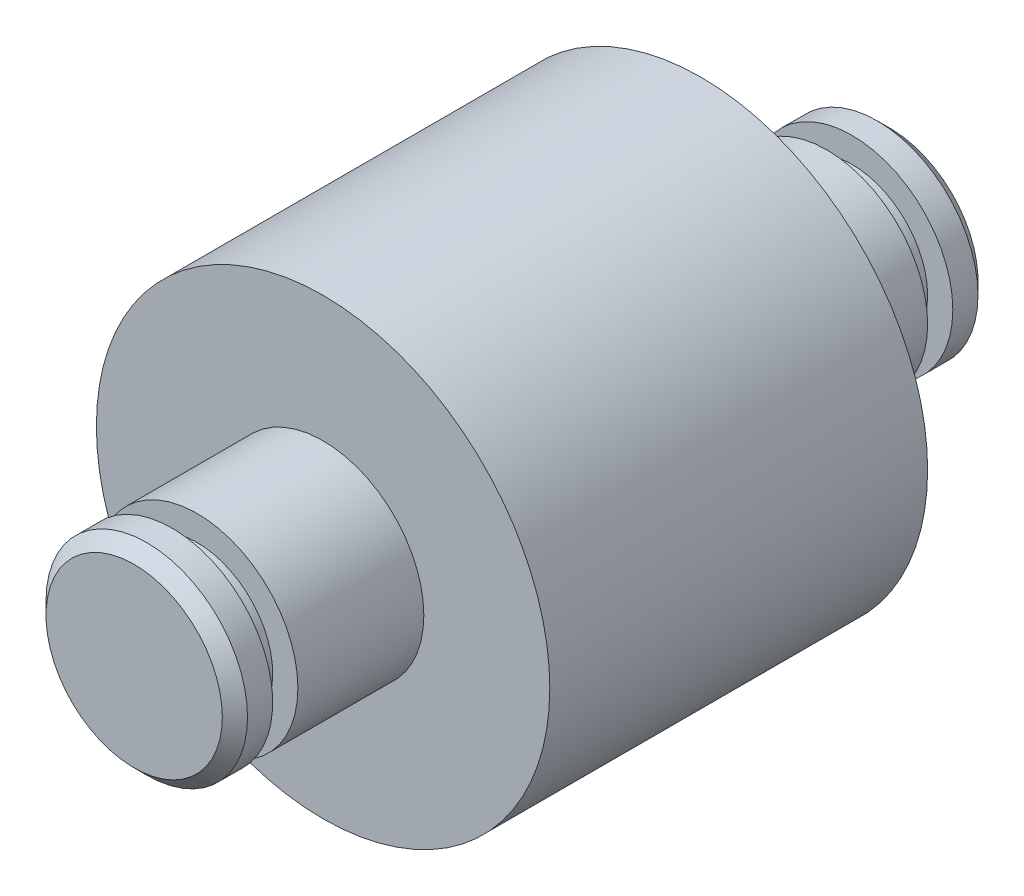
ISO-10303-21;
HEADER;
FILE_DESCRIPTION(('STEP AP214'),'2;1');
FILE_NAME('part.step','',(''),(''),'','','');
FILE_SCHEMA(('AUTOMOTIVE_DESIGN { 1 0 10303 214 1 1 1 1 }'));
ENDSEC;
DATA;
#1=APPLICATION_CONTEXT('core data for automotive mechanical design processes');
#2=APPLICATION_PROTOCOL_DEFINITION('international standard','automotive_design',2000,#1);
#3=PRODUCT_CONTEXT('',#1,'mechanical');
#4=PRODUCT('Part','Part','',(#3));
#5=PRODUCT_RELATED_PRODUCT_CATEGORY('part','',(#4));
#6=PRODUCT_DEFINITION_FORMATION('','',#4);
#7=PRODUCT_DEFINITION_CONTEXT('part definition',#1,'design');
#8=PRODUCT_DEFINITION('design','',#6,#7);
#9=PRODUCT_DEFINITION_SHAPE('','',#8);
#10=(LENGTH_UNIT() NAMED_UNIT(*) SI_UNIT(.MILLI.,.METRE.));
#11=(NAMED_UNIT(*) PLANE_ANGLE_UNIT() SI_UNIT($,.RADIAN.));
#12=(NAMED_UNIT(*) SI_UNIT($,.STERADIAN.) SOLID_ANGLE_UNIT());
#13=UNCERTAINTY_MEASURE_WITH_UNIT(LENGTH_MEASURE(1.E-05),#10,'distance_accuracy_value','');
#14=(GEOMETRIC_REPRESENTATION_CONTEXT(3) GLOBAL_UNCERTAINTY_ASSIGNED_CONTEXT((#13)) GLOBAL_UNIT_ASSIGNED_CONTEXT((#10,
#11,#12)) REPRESENTATION_CONTEXT('',''));
#15=CARTESIAN_POINT('',(0.,0.,0.));
#16=DIRECTION('',(0.,0.,1.));
#17=DIRECTION('',(1.,0.,0.));
#18=AXIS2_PLACEMENT_3D('',#15,#16,#17);
#19=CARTESIAN_POINT('',(0.,0.,-15.));
#20=DIRECTION('',(0.,0.,1.));
#21=DIRECTION('',(1.,0.,0.));
#22=AXIS2_PLACEMENT_3D('',#19,#20,#21);
#23=CYLINDRICAL_SURFACE('',#22,4.);
#24=CARTESIAN_POINT('',(0.,0.,-7.5));
#25=DIRECTION('',(0.,0.,1.));
#26=DIRECTION('',(1.,0.,0.));
#27=AXIS2_PLACEMENT_3D('',#24,#25,#26);
#28=CIRCLE('',#27,4.);
#29=CARTESIAN_POINT('',(4.,0.,-7.5));
#30=VERTEX_POINT('',#29);
#31=EDGE_CURVE('E53',#30,#30,#28,.T.);
#32=ORIENTED_EDGE('',*,*,#31,.F.);
#33=EDGE_LOOP('',(#32));
#34=FACE_BOUND('',#33,.T.);
#35=CARTESIAN_POINT('',(0.,0.,-12.5));
#36=DIRECTION('',(0.,0.,-1.));
#37=DIRECTION('',(-1.,0.,0.));
#38=AXIS2_PLACEMENT_3D('',#35,#36,#37);
#39=CIRCLE('',#38,4.);
#40=CARTESIAN_POINT('',(-4.,0.,-12.5));
#41=VERTEX_POINT('',#40);
#42=EDGE_CURVE('E54',#41,#41,#39,.F.);
#43=ORIENTED_EDGE('',*,*,#42,.T.);
#44=EDGE_LOOP('',(#43));
#45=FACE_BOUND('',#44,.T.);
#46=ADVANCED_FACE('F32',(#34,#45),#23,.T.);
#47=CARTESIAN_POINT('',(0.,0.,15.));
#48=DIRECTION('',(0.,0.,-1.));
#49=DIRECTION('',(-1.,0.,0.));
#50=AXIS2_PLACEMENT_3D('',#47,#48,#49);
#51=CYLINDRICAL_SURFACE('',#50,4.);
#52=CARTESIAN_POINT('',(0.,0.,7.5));
#53=DIRECTION('',(0.,0.,1.));
#54=DIRECTION('',(1.,0.,0.));
#55=AXIS2_PLACEMENT_3D('',#52,#53,#54);
#56=CIRCLE('',#55,4.);
#57=CARTESIAN_POINT('',(4.,0.,7.5));
#58=VERTEX_POINT('',#57);
#59=EDGE_CURVE('E60',#58,#58,#56,.T.);
#60=ORIENTED_EDGE('',*,*,#59,.T.);
#61=EDGE_LOOP('',(#60));
#62=FACE_BOUND('',#61,.T.);
#63=CARTESIAN_POINT('',(0.,0.,12.5));
#64=DIRECTION('',(0.,0.,1.));
#65=DIRECTION('',(1.,0.,0.));
#66=AXIS2_PLACEMENT_3D('',#63,#64,#65);
#67=CIRCLE('',#66,4.);
#68=CARTESIAN_POINT('',(4.,0.,12.5));
#69=VERTEX_POINT('',#68);
#70=EDGE_CURVE('E65',#69,#69,#67,.T.);
#71=ORIENTED_EDGE('',*,*,#70,.F.);
#72=EDGE_LOOP('',(#71));
#73=FACE_BOUND('',#72,.T.);
#74=ADVANCED_FACE('F111',(#62,#73),#51,.T.);
#75=CARTESIAN_POINT('',(0.,0.,7.5));
#76=DIRECTION('',(0.,0.,-1.));
#77=DIRECTION('',(-1.,0.,0.));
#78=AXIS2_PLACEMENT_3D('',#75,#76,#77);
#79=CYLINDRICAL_SURFACE('',#78,9.);
#80=CARTESIAN_POINT('',(0.,0.,7.5));
#81=DIRECTION('',(0.,0.,1.));
#82=DIRECTION('',(1.,0.,0.));
#83=AXIS2_PLACEMENT_3D('',#80,#81,#82);
#84=CIRCLE('',#83,9.);
#85=CARTESIAN_POINT('',(9.,0.,7.5));
#86=VERTEX_POINT('',#85);
#87=EDGE_CURVE('E64',#86,#86,#84,.T.);
#88=ORIENTED_EDGE('',*,*,#87,.F.);
#89=EDGE_LOOP('',(#88));
#90=FACE_BOUND('',#89,.T.);
#91=CARTESIAN_POINT('',(0.,0.,-7.5));
#92=DIRECTION('',(0.,0.,1.));
#93=DIRECTION('',(1.,0.,0.));
#94=AXIS2_PLACEMENT_3D('',#91,#92,#93);
#95=CIRCLE('',#94,9.);
#96=CARTESIAN_POINT('',(9.,0.,-7.5));
#97=VERTEX_POINT('',#96);
#98=EDGE_CURVE('E78',#97,#97,#95,.T.);
#99=ORIENTED_EDGE('',*,*,#98,.T.);
#100=EDGE_LOOP('',(#99));
#101=FACE_BOUND('',#100,.T.);
#102=ADVANCED_FACE('F118',(#90,#101),#79,.T.);
#103=CARTESIAN_POINT('',(0.,0.,7.5));
#104=DIRECTION('',(0.,0.,1.));
#105=DIRECTION('',(1.,0.,0.));
#106=AXIS2_PLACEMENT_3D('',#103,#104,#105);
#107=PLANE('',#106);
#108=ORIENTED_EDGE('',*,*,#59,.F.);
#109=EDGE_LOOP('',(#108));
#110=FACE_BOUND('',#109,.T.);
#111=ORIENTED_EDGE('',*,*,#87,.T.);
#112=EDGE_LOOP('',(#111));
#113=FACE_BOUND('',#112,.T.);
#114=ADVANCED_FACE('F165',(#110,#113),#107,.T.);
#115=CARTESIAN_POINT('',(0.,4.61399314228175,13.5));
#116=DIRECTION('',(0.,0.,-1.));
#117=DIRECTION('',(-1.,0.,0.));
#118=AXIS2_PLACEMENT_3D('',#115,#116,#117);
#119=PLANE('',#118);
#120=CARTESIAN_POINT('',(0.,0.,13.5));
#121=DIRECTION('',(0.,0.,1.));
#122=DIRECTION('',(1.,0.,0.));
#123=AXIS2_PLACEMENT_3D('',#120,#121,#122);
#124=CIRCLE('',#123,3.);
#125=CARTESIAN_POINT('',(3.,0.,13.5));
#126=VERTEX_POINT('',#125);
#127=EDGE_CURVE('E68',#126,#126,#124,.T.);
#128=ORIENTED_EDGE('',*,*,#127,.T.);
#129=EDGE_LOOP('',(#128));
#130=FACE_BOUND('',#129,.T.);
#131=CARTESIAN_POINT('',(0.,0.,13.5));
#132=DIRECTION('',(0.,0.,-1.));
#133=DIRECTION('',(-1.,0.,0.));
#134=AXIS2_PLACEMENT_3D('',#131,#132,#133);
#135=CIRCLE('',#134,4.);
#136=CARTESIAN_POINT('',(-4.,0.,13.5));
#137=VERTEX_POINT('',#136);
#138=EDGE_CURVE('E61',#137,#137,#135,.T.);
#139=ORIENTED_EDGE('',*,*,#138,.T.);
#140=EDGE_LOOP('',(#139));
#141=FACE_BOUND('',#140,.T.);
#142=ADVANCED_FACE('F221',(#130,#141),#119,.T.);
#143=CARTESIAN_POINT('',(0.,4.61399314228175,12.5));
#144=DIRECTION('',(0.,0.,1.));
#145=DIRECTION('',(1.,0.,0.));
#146=AXIS2_PLACEMENT_3D('',#143,#144,#145);
#147=PLANE('',#146);
#148=CARTESIAN_POINT('',(0.,0.,12.5));
#149=DIRECTION('',(0.,0.,1.));
#150=DIRECTION('',(1.,0.,0.));
#151=AXIS2_PLACEMENT_3D('',#148,#149,#150);
#152=CIRCLE('',#151,3.);
#153=CARTESIAN_POINT('',(3.,0.,12.5));
#154=VERTEX_POINT('',#153);
#155=EDGE_CURVE('E75',#154,#154,#152,.T.);
#156=ORIENTED_EDGE('',*,*,#155,.F.);
#157=EDGE_LOOP('',(#156));
#158=FACE_BOUND('',#157,.T.);
#159=ORIENTED_EDGE('',*,*,#70,.T.);
#160=EDGE_LOOP('',(#159));
#161=FACE_BOUND('',#160,.T.);
#162=ADVANCED_FACE('F211',(#158,#161),#147,.T.);
#163=CARTESIAN_POINT('',(0.,0.,15.));
#164=DIRECTION('',(0.,0.,1.));
#165=DIRECTION('',(1.,0.,0.));
#166=AXIS2_PLACEMENT_3D('',#163,#164,#165);
#167=CYLINDRICAL_SURFACE('',#166,3.);
#168=ORIENTED_EDGE('',*,*,#155,.T.);
#169=EDGE_LOOP('',(#168));
#170=FACE_BOUND('',#169,.T.);
#171=ORIENTED_EDGE('',*,*,#127,.F.);
#172=EDGE_LOOP('',(#171));
#173=FACE_BOUND('',#172,.T.);
#174=ADVANCED_FACE('F201',(#170,#173),#167,.T.);
#175=CARTESIAN_POINT('',(0.,0.,15.));
#176=DIRECTION('',(0.,0.,1.));
#177=DIRECTION('',(1.,0.,0.));
#178=AXIS2_PLACEMENT_3D('',#175,#176,#177);
#179=PLANE('',#178);
#180=CARTESIAN_POINT('',(0.,0.,15.));
#181=DIRECTION('',(0.,0.,1.));
#182=DIRECTION('',(1.,0.,0.));
#183=AXIS2_PLACEMENT_3D('',#180,#181,#182);
#184=CIRCLE('',#183,3.5);
#185=CARTESIAN_POINT('',(3.5,0.,15.));
#186=VERTEX_POINT('',#185);
#187=EDGE_CURVE('E47',#186,#186,#184,.T.);
#188=ORIENTED_EDGE('',*,*,#187,.T.);
#189=EDGE_LOOP('',(#188));
#190=FACE_BOUND('',#189,.T.);
#191=ADVANCED_FACE('F190',(#190),#179,.T.);
#192=CARTESIAN_POINT('',(0.,0.,14.5));
#193=DIRECTION('',(0.,0.,1.));
#194=DIRECTION('',(1.,0.,0.));
#195=AXIS2_PLACEMENT_3D('',#192,#193,#194);
#196=CIRCLE('',#195,4.);
#197=CARTESIAN_POINT('',(4.,0.,14.5));
#198=VERTEX_POINT('',#197);
#199=EDGE_CURVE('E43',#198,#198,#196,.F.);
#200=ORIENTED_EDGE('',*,*,#199,.T.);
#201=EDGE_LOOP('',(#200));
#202=FACE_BOUND('',#201,.T.);
#203=ORIENTED_EDGE('',*,*,#138,.F.);
#204=EDGE_LOOP('',(#203));
#205=FACE_BOUND('',#204,.T.);
#206=ADVANCED_FACE('F121',(#202,#205),#51,.T.);
#207=CARTESIAN_POINT('',(0.,0.,15.));
#208=DIRECTION('',(0.,0.,-1.));
#209=DIRECTION('',(-1.,0.,0.));
#210=AXIS2_PLACEMENT_3D('',#207,#208,#209);
#211=CONICAL_SURFACE('',#210,3.5,0.785398163397448);
#212=ORIENTED_EDGE('',*,*,#199,.F.);
#213=EDGE_LOOP('',(#212));
#214=FACE_BOUND('',#213,.T.);
#215=ORIENTED_EDGE('',*,*,#187,.F.);
#216=EDGE_LOOP('',(#215));
#217=FACE_BOUND('',#216,.T.);
#218=ADVANCED_FACE('F105',(#214,#217),#211,.T.);
#219=CARTESIAN_POINT('',(0.,0.,-7.5));
#220=DIRECTION('',(0.,0.,-1.));
#221=DIRECTION('',(1.,0.,0.));
#222=AXIS2_PLACEMENT_3D('',#219,#220,#221);
#223=PLANE('',#222);
#224=ORIENTED_EDGE('',*,*,#31,.T.);
#225=EDGE_LOOP('',(#224));
#226=FACE_BOUND('',#225,.T.);
#227=ORIENTED_EDGE('',*,*,#98,.F.);
#228=EDGE_LOOP('',(#227));
#229=FACE_BOUND('',#228,.T.);
#230=ADVANCED_FACE('F99',(#226,#229),#223,.T.);
#231=CARTESIAN_POINT('',(0.,4.61399314228175,-13.5));
#232=DIRECTION('',(0.,0.,1.));
#233=DIRECTION('',(-1.,0.,0.));
#234=AXIS2_PLACEMENT_3D('',#231,#232,#233);
#235=PLANE('',#234);
#236=CARTESIAN_POINT('',(0.,0.,-13.5));
#237=DIRECTION('',(0.,0.,1.));
#238=DIRECTION('',(1.,0.,0.));
#239=AXIS2_PLACEMENT_3D('',#236,#237,#238);
#240=CIRCLE('',#239,4.);
#241=CARTESIAN_POINT('',(4.,0.,-13.5));
#242=VERTEX_POINT('',#241);
#243=EDGE_CURVE('E50',#242,#242,#240,.F.);
#244=ORIENTED_EDGE('',*,*,#243,.F.);
#245=EDGE_LOOP('',(#244));
#246=FACE_BOUND('',#245,.T.);
#247=CARTESIAN_POINT('',(0.,0.,-13.5));
#248=DIRECTION('',(0.,0.,1.));
#249=DIRECTION('',(1.,0.,0.));
#250=AXIS2_PLACEMENT_3D('',#247,#248,#249);
#251=CIRCLE('',#250,3.);
#252=CARTESIAN_POINT('',(3.,0.,-13.5));
#253=VERTEX_POINT('',#252);
#254=EDGE_CURVE('E56',#253,#253,#251,.T.);
#255=ORIENTED_EDGE('',*,*,#254,.F.);
#256=EDGE_LOOP('',(#255));
#257=FACE_BOUND('',#256,.T.);
#258=ADVANCED_FACE('F94',(#246,#257),#235,.T.);
#259=CARTESIAN_POINT('',(0.,0.,-15.));
#260=DIRECTION('',(0.,0.,-1.));
#261=DIRECTION('',(1.,0.,0.));
#262=AXIS2_PLACEMENT_3D('',#259,#260,#261);
#263=CYLINDRICAL_SURFACE('',#262,3.);
#264=CARTESIAN_POINT('',(0.,0.,-12.5));
#265=DIRECTION('',(0.,0.,1.));
#266=DIRECTION('',(1.,0.,0.));
#267=AXIS2_PLACEMENT_3D('',#264,#265,#266);
#268=CIRCLE('',#267,3.);
#269=CARTESIAN_POINT('',(3.,0.,-12.5));
#270=VERTEX_POINT('',#269);
#271=EDGE_CURVE('E85',#270,#270,#268,.T.);
#272=ORIENTED_EDGE('',*,*,#271,.F.);
#273=EDGE_LOOP('',(#272));
#274=FACE_BOUND('',#273,.T.);
#275=ORIENTED_EDGE('',*,*,#254,.T.);
#276=EDGE_LOOP('',(#275));
#277=FACE_BOUND('',#276,.T.);
#278=ADVANCED_FACE('F91',(#274,#277),#263,.T.);
#279=CARTESIAN_POINT('',(0.,4.61399314228175,-12.5));
#280=DIRECTION('',(0.,0.,-1.));
#281=DIRECTION('',(1.,0.,0.));
#282=AXIS2_PLACEMENT_3D('',#279,#280,#281);
#283=PLANE('',#282);
#284=ORIENTED_EDGE('',*,*,#42,.F.);
#285=EDGE_LOOP('',(#284));
#286=FACE_BOUND('',#285,.T.);
#287=ORIENTED_EDGE('',*,*,#271,.T.);
#288=EDGE_LOOP('',(#287));
#289=FACE_BOUND('',#288,.T.);
#290=ADVANCED_FACE('F89',(#286,#289),#283,.T.);
#291=CARTESIAN_POINT('',(0.,0.,-15.));
#292=DIRECTION('',(0.,0.,-1.));
#293=DIRECTION('',(1.,0.,0.));
#294=AXIS2_PLACEMENT_3D('',#291,#292,#293);
#295=PLANE('',#294);
#296=CARTESIAN_POINT('',(0.,0.,-15.));
#297=DIRECTION('',(0.,0.,-1.));
#298=DIRECTION('',(-1.,0.,0.));
#299=AXIS2_PLACEMENT_3D('',#296,#297,#298);
#300=CIRCLE('',#299,3.5);
#301=CARTESIAN_POINT('',(-3.5,0.,-15.));
#302=VERTEX_POINT('',#301);
#303=EDGE_CURVE('E10',#302,#302,#300,.T.);
#304=ORIENTED_EDGE('',*,*,#303,.T.);
#305=EDGE_LOOP('',(#304));
#306=FACE_BOUND('',#305,.T.);
#307=ADVANCED_FACE('F125',(#306),#295,.T.);
#308=CARTESIAN_POINT('',(0.,0.,-14.5));
#309=DIRECTION('',(0.,0.,-1.));
#310=DIRECTION('',(-1.,0.,0.));
#311=AXIS2_PLACEMENT_3D('',#308,#309,#310);
#312=CIRCLE('',#311,4.);
#313=CARTESIAN_POINT('',(-4.,0.,-14.5));
#314=VERTEX_POINT('',#313);
#315=EDGE_CURVE('E39',#314,#314,#312,.F.);
#316=ORIENTED_EDGE('',*,*,#315,.T.);
#317=EDGE_LOOP('',(#316));
#318=FACE_BOUND('',#317,.T.);
#319=ORIENTED_EDGE('',*,*,#243,.T.);
#320=EDGE_LOOP('',(#319));
#321=FACE_BOUND('',#320,.T.);
#322=ADVANCED_FACE('F114',(#318,#321),#23,.T.);
#323=CARTESIAN_POINT('',(0.,0.,-14.5));
#324=DIRECTION('',(0.,0.,1.));
#325=DIRECTION('',(1.,0.,0.));
#326=AXIS2_PLACEMENT_3D('',#323,#324,#325);
#327=CONICAL_SURFACE('',#326,4.,0.785398163397443);
#328=ORIENTED_EDGE('',*,*,#303,.F.);
#329=EDGE_LOOP('',(#328));
#330=FACE_BOUND('',#329,.T.);
#331=ORIENTED_EDGE('',*,*,#315,.F.);
#332=EDGE_LOOP('',(#331));
#333=FACE_BOUND('',#332,.T.);
#334=ADVANCED_FACE('F34',(#330,#333),#327,.T.);
#335=CLOSED_SHELL('',(#46,#74,#102,#114,#142,#162,#174,#191,#206,#218,#230,#258,#278,#290,#307,
#322,#334));
#336=MANIFOLD_SOLID_BREP('B2',#335);
#337=ADVANCED_BREP_SHAPE_REPRESENTATION('',(#18,#336),#14);
#338=SHAPE_DEFINITION_REPRESENTATION(#9,#337);
ENDSEC;
END-ISO-10303-21;
